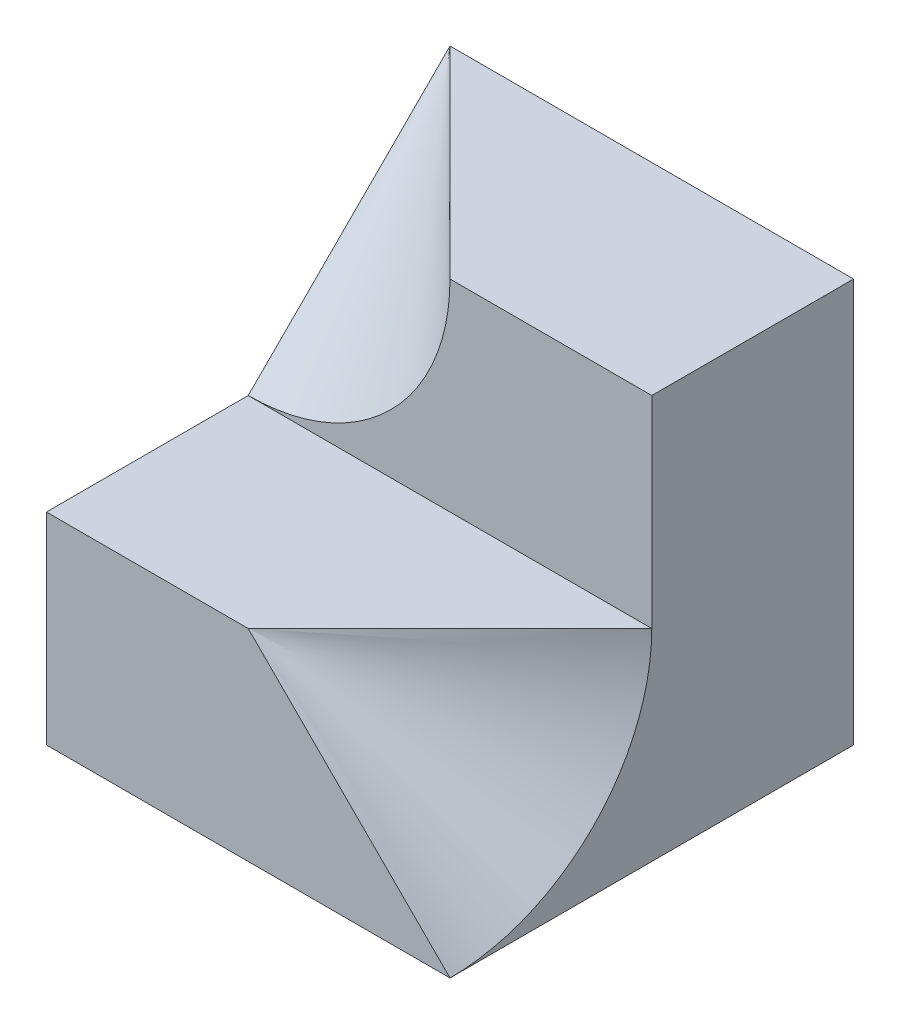
ISO-10303-21;
HEADER;
FILE_DESCRIPTION(('STEP AP214'),'2;1');
FILE_NAME('part.step','',(''),(''),'','','');
FILE_SCHEMA(('AUTOMOTIVE_DESIGN { 1 0 10303 214 1 1 1 1 }'));
ENDSEC;
DATA;
#1=APPLICATION_CONTEXT('core data for automotive mechanical design processes');
#2=APPLICATION_PROTOCOL_DEFINITION('international standard','automotive_design',2000,#1);
#3=PRODUCT_CONTEXT('',#1,'mechanical');
#4=PRODUCT('Part','Part','',(#3));
#5=PRODUCT_RELATED_PRODUCT_CATEGORY('part','',(#4));
#6=PRODUCT_DEFINITION_FORMATION('','',#4);
#7=PRODUCT_DEFINITION_CONTEXT('part definition',#1,'design');
#8=PRODUCT_DEFINITION('design','',#6,#7);
#9=PRODUCT_DEFINITION_SHAPE('','',#8);
#10=(LENGTH_UNIT() NAMED_UNIT(*) SI_UNIT(.MILLI.,.METRE.));
#11=(NAMED_UNIT(*) PLANE_ANGLE_UNIT() SI_UNIT($,.RADIAN.));
#12=(NAMED_UNIT(*) SI_UNIT($,.STERADIAN.) SOLID_ANGLE_UNIT());
#13=UNCERTAINTY_MEASURE_WITH_UNIT(LENGTH_MEASURE(1.E-05),#10,'distance_accuracy_value','');
#14=(GEOMETRIC_REPRESENTATION_CONTEXT(3) GLOBAL_UNCERTAINTY_ASSIGNED_CONTEXT((#13)) GLOBAL_UNIT_ASSIGNED_CONTEXT((#10,
#11,#12)) REPRESENTATION_CONTEXT('',''));
#15=CARTESIAN_POINT('',(0.,0.,0.));
#16=DIRECTION('',(0.,0.,1.));
#17=DIRECTION('',(1.,0.,0.));
#18=AXIS2_PLACEMENT_3D('',#15,#16,#17);
#19=CARTESIAN_POINT('',(0.,4.,0.));
#20=DIRECTION('',(0.,0.,-1.));
#21=DIRECTION('',(-1.,0.,0.));
#22=AXIS2_PLACEMENT_3D('',#19,#20,#21);
#23=PLANE('',#22);
#24=DIRECTION('',(-0.707106781186548,0.707106781186547,0.));
#25=VECTOR('',#24,1.);
#26=CARTESIAN_POINT('',(2.,2.,0.));
#27=LINE('',#26,#25);
#28=CARTESIAN_POINT('',(2.,2.,0.));
#29=VERTEX_POINT('',#28);
#30=CARTESIAN_POINT('',(4.,0.,0.));
#31=VERTEX_POINT('',#30);
#32=EDGE_CURVE('E132',#29,#31,#27,.F.);
#33=ORIENTED_EDGE('',*,*,#32,.F.);
#34=DIRECTION('',(-1.,0.,0.));
#35=VECTOR('',#34,1.);
#36=CARTESIAN_POINT('',(4.,2.,0.));
#37=LINE('',#36,#35);
#38=CARTESIAN_POINT('',(0.,2.,0.));
#39=VERTEX_POINT('',#38);
#40=EDGE_CURVE('E107',#29,#39,#37,.T.);
#41=ORIENTED_EDGE('',*,*,#40,.T.);
#42=DIRECTION('',(0.,-1.,0.));
#43=VECTOR('',#42,1.);
#44=CARTESIAN_POINT('',(0.,4.,0.));
#45=LINE('',#44,#43);
#46=CARTESIAN_POINT('',(0.,0.,0.));
#47=VERTEX_POINT('',#46);
#48=EDGE_CURVE('E41',#39,#47,#45,.T.);
#49=ORIENTED_EDGE('',*,*,#48,.T.);
#50=DIRECTION('',(1.,0.,0.));
#51=VECTOR('',#50,1.);
#52=CARTESIAN_POINT('',(0.,0.,0.));
#53=LINE('',#52,#51);
#54=EDGE_CURVE('E85',#47,#31,#53,.T.);
#55=ORIENTED_EDGE('',*,*,#54,.T.);
#56=EDGE_LOOP('',(#33,#41,#49,#55));
#57=FACE_BOUND('',#56,.T.);
#58=ADVANCED_FACE('F33',(#57),#23,.F.);
#59=CARTESIAN_POINT('',(4.,2.,-2.));
#60=DIRECTION('',(0.,-1.,0.));
#61=DIRECTION('',(0.,0.,-1.));
#62=AXIS2_PLACEMENT_3D('',#59,#60,#61);
#63=PLANE('',#62);
#64=DIRECTION('',(0.707106781186548,0.,-0.707106781186547));
#65=VECTOR('',#64,1.);
#66=CARTESIAN_POINT('',(2.,2.,0.));
#67=LINE('',#66,#65);
#68=CARTESIAN_POINT('',(4.,2.,-2.));
#69=VERTEX_POINT('',#68);
#70=EDGE_CURVE('E11',#69,#29,#67,.F.);
#71=ORIENTED_EDGE('',*,*,#70,.F.);
#72=DIRECTION('',(-1.,0.,0.));
#73=VECTOR('',#72,1.);
#74=CARTESIAN_POINT('',(4.,2.,-2.));
#75=LINE('',#74,#73);
#76=CARTESIAN_POINT('',(0.,2.,-2.));
#77=VERTEX_POINT('',#76);
#78=EDGE_CURVE('E117',#69,#77,#75,.T.);
#79=ORIENTED_EDGE('',*,*,#78,.T.);
#80=DIRECTION('',(0.,0.,1.));
#81=VECTOR('',#80,1.);
#82=CARTESIAN_POINT('',(0.,2.,-2.));
#83=LINE('',#82,#81);
#84=EDGE_CURVE('E121',#77,#39,#83,.T.);
#85=ORIENTED_EDGE('',*,*,#84,.T.);
#86=ORIENTED_EDGE('',*,*,#40,.F.);
#87=EDGE_LOOP('',(#71,#79,#85,#86));
#88=FACE_BOUND('',#87,.T.);
#89=ADVANCED_FACE('F141',(#88),#63,.F.);
#90=CARTESIAN_POINT('',(0.,4.,0.));
#91=DIRECTION('',(1.,0.,0.));
#92=DIRECTION('',(0.,0.,-1.));
#93=AXIS2_PLACEMENT_3D('',#90,#91,#92);
#94=PLANE('',#93);
#95=ORIENTED_EDGE('',*,*,#84,.F.);
#96=DIRECTION('',(0.,0.707106781186547,-0.707106781186548));
#97=VECTOR('',#96,1.);
#98=CARTESIAN_POINT('',(0.,4.,-4.));
#99=LINE('',#98,#97);
#100=CARTESIAN_POINT('',(0.,4.,-4.));
#101=VERTEX_POINT('',#100);
#102=EDGE_CURVE('E123',#77,#101,#99,.T.);
#103=ORIENTED_EDGE('',*,*,#102,.T.);
#104=DIRECTION('',(0.,-1.,0.));
#105=VECTOR('',#104,1.);
#106=CARTESIAN_POINT('',(0.,4.,-4.));
#107=LINE('',#106,#105);
#108=CARTESIAN_POINT('',(0.,0.,-4.));
#109=VERTEX_POINT('',#108);
#110=EDGE_CURVE('E92',#101,#109,#107,.T.);
#111=ORIENTED_EDGE('',*,*,#110,.T.);
#112=DIRECTION('',(0.,0.,1.));
#113=VECTOR('',#112,1.);
#114=CARTESIAN_POINT('',(0.,0.,0.));
#115=LINE('',#114,#113);
#116=EDGE_CURVE('E97',#109,#47,#115,.T.);
#117=ORIENTED_EDGE('',*,*,#116,.T.);
#118=ORIENTED_EDGE('',*,*,#48,.F.);
#119=EDGE_LOOP('',(#95,#103,#111,#117,#118));
#120=FACE_BOUND('',#119,.T.);
#121=ADVANCED_FACE('F35',(#120),#94,.F.);
#122=CARTESIAN_POINT('',(4.,4.,0.));
#123=DIRECTION('',(-1.,0.,0.));
#124=DIRECTION('',(0.,0.,1.));
#125=AXIS2_PLACEMENT_3D('',#122,#123,#124);
#126=PLANE('',#125);
#127=CARTESIAN_POINT('',(4.,2.,0.));
#128=DIRECTION('',(1.,0.,0.));
#129=DIRECTION('',(0.,0.,-1.));
#130=AXIS2_PLACEMENT_3D('',#127,#128,#129);
#131=CIRCLE('',#130,2.);
#132=EDGE_CURVE('E79',#31,#69,#131,.T.);
#133=ORIENTED_EDGE('',*,*,#132,.F.);
#134=DIRECTION('',(0.,0.,-1.));
#135=VECTOR('',#134,1.);
#136=CARTESIAN_POINT('',(4.,0.,0.));
#137=LINE('',#136,#135);
#138=CARTESIAN_POINT('',(4.,0.,-4.));
#139=VERTEX_POINT('',#138);
#140=EDGE_CURVE('E72',#31,#139,#137,.T.);
#141=ORIENTED_EDGE('',*,*,#140,.T.);
#142=DIRECTION('',(0.,-1.,0.));
#143=VECTOR('',#142,1.);
#144=CARTESIAN_POINT('',(4.,4.,-4.));
#145=LINE('',#144,#143);
#146=CARTESIAN_POINT('',(4.,4.,-4.));
#147=VERTEX_POINT('',#146);
#148=EDGE_CURVE('E75',#147,#139,#145,.T.);
#149=ORIENTED_EDGE('',*,*,#148,.F.);
#150=DIRECTION('',(0.,0.,-1.));
#151=VECTOR('',#150,1.);
#152=CARTESIAN_POINT('',(4.,4.,0.));
#153=LINE('',#152,#151);
#154=CARTESIAN_POINT('',(4.,4.,-2.));
#155=VERTEX_POINT('',#154);
#156=EDGE_CURVE('E56',#155,#147,#153,.T.);
#157=ORIENTED_EDGE('',*,*,#156,.F.);
#158=DIRECTION('',(0.,-1.,0.));
#159=VECTOR('',#158,1.);
#160=CARTESIAN_POINT('',(4.,4.,-2.));
#161=LINE('',#160,#159);
#162=EDGE_CURVE('E48',#155,#69,#161,.T.);
#163=ORIENTED_EDGE('',*,*,#162,.T.);
#164=EDGE_LOOP('',(#133,#141,#149,#157,#163));
#165=FACE_BOUND('',#164,.T.);
#166=ADVANCED_FACE('F74',(#165),#126,.F.);
#167=CARTESIAN_POINT('',(0.,4.,-4.));
#168=DIRECTION('',(0.,0.,1.));
#169=DIRECTION('',(1.,0.,0.));
#170=AXIS2_PLACEMENT_3D('',#167,#168,#169);
#171=PLANE('',#170);
#172=DIRECTION('',(-1.,0.,0.));
#173=VECTOR('',#172,1.);
#174=CARTESIAN_POINT('',(0.,0.,-4.));
#175=LINE('',#174,#173);
#176=EDGE_CURVE('E84',#139,#109,#175,.T.);
#177=ORIENTED_EDGE('',*,*,#176,.T.);
#178=ORIENTED_EDGE('',*,*,#110,.F.);
#179=DIRECTION('',(-1.,0.,0.));
#180=VECTOR('',#179,1.);
#181=CARTESIAN_POINT('',(0.,4.,-4.));
#182=LINE('',#181,#180);
#183=EDGE_CURVE('E91',#147,#101,#182,.T.);
#184=ORIENTED_EDGE('',*,*,#183,.F.);
#185=ORIENTED_EDGE('',*,*,#148,.T.);
#186=EDGE_LOOP('',(#177,#178,#184,#185));
#187=FACE_BOUND('',#186,.T.);
#188=ADVANCED_FACE('F88',(#187),#171,.F.);
#189=CARTESIAN_POINT('',(0.,4.,0.));
#190=DIRECTION('',(0.,-1.,0.));
#191=DIRECTION('',(0.,0.,-1.));
#192=AXIS2_PLACEMENT_3D('',#189,#190,#191);
#193=PLANE('',#192);
#194=ORIENTED_EDGE('',*,*,#183,.T.);
#195=DIRECTION('',(0.707106781186547,0.,0.707106781186548));
#196=VECTOR('',#195,1.);
#197=CARTESIAN_POINT('',(0.,4.,-4.));
#198=LINE('',#197,#196);
#199=CARTESIAN_POINT('',(2.,4.,-2.));
#200=VERTEX_POINT('',#199);
#201=EDGE_CURVE('E126',#101,#200,#198,.T.);
#202=ORIENTED_EDGE('',*,*,#201,.T.);
#203=DIRECTION('',(-1.,0.,0.));
#204=VECTOR('',#203,1.);
#205=CARTESIAN_POINT('',(4.,4.,-2.));
#206=LINE('',#205,#204);
#207=EDGE_CURVE('E112',#155,#200,#206,.T.);
#208=ORIENTED_EDGE('',*,*,#207,.F.);
#209=ORIENTED_EDGE('',*,*,#156,.T.);
#210=EDGE_LOOP('',(#194,#202,#208,#209));
#211=FACE_BOUND('',#210,.T.);
#212=ADVANCED_FACE('F152',(#211),#193,.F.);
#213=CARTESIAN_POINT('',(0.,0.,0.));
#214=DIRECTION('',(0.,-1.,0.));
#215=DIRECTION('',(0.,0.,-1.));
#216=AXIS2_PLACEMENT_3D('',#213,#214,#215);
#217=PLANE('',#216);
#218=ORIENTED_EDGE('',*,*,#116,.F.);
#219=ORIENTED_EDGE('',*,*,#176,.F.);
#220=ORIENTED_EDGE('',*,*,#140,.F.);
#221=ORIENTED_EDGE('',*,*,#54,.F.);
#222=EDGE_LOOP('',(#218,#219,#220,#221));
#223=FACE_BOUND('',#222,.T.);
#224=ADVANCED_FACE('F95',(#223),#217,.T.);
#225=CARTESIAN_POINT('',(4.,4.,-2.));
#226=DIRECTION('',(0.,0.,-1.));
#227=DIRECTION('',(-1.,0.,0.));
#228=AXIS2_PLACEMENT_3D('',#225,#226,#227);
#229=PLANE('',#228);
#230=ORIENTED_EDGE('',*,*,#207,.T.);
#231=CARTESIAN_POINT('',(0.,4.,-2.));
#232=DIRECTION('',(0.,0.,-1.));
#233=DIRECTION('',(-1.,0.,0.));
#234=AXIS2_PLACEMENT_3D('',#231,#232,#233);
#235=CIRCLE('',#234,2.);
#236=EDGE_CURVE('E129',#200,#77,#235,.T.);
#237=ORIENTED_EDGE('',*,*,#236,.T.);
#238=ORIENTED_EDGE('',*,*,#78,.F.);
#239=ORIENTED_EDGE('',*,*,#162,.F.);
#240=EDGE_LOOP('',(#230,#237,#238,#239));
#241=FACE_BOUND('',#240,.T.);
#242=ADVANCED_FACE('F143',(#241),#229,.F.);
#243=CARTESIAN_POINT('',(0.,4.,-4.));
#244=DIRECTION('',(0.,0.,1.));
#245=DIRECTION('',(1.,0.,0.));
#246=AXIS2_PLACEMENT_3D('',#243,#244,#245);
#247=CONICAL_SURFACE('',#246,0.,0.785398163397448);
#248=ORIENTED_EDGE('',*,*,#236,.F.);
#249=ORIENTED_EDGE('',*,*,#201,.F.);
#250=ORIENTED_EDGE('',*,*,#102,.F.);
#251=EDGE_LOOP('',(#248,#249,#250));
#252=FACE_BOUND('',#251,.T.);
#253=ADVANCED_FACE('F149',(#252),#247,.F.);
#254=CARTESIAN_POINT('',(2.,2.,0.));
#255=DIRECTION('',(1.,0.,0.));
#256=DIRECTION('',(0.,0.,-1.));
#257=AXIS2_PLACEMENT_3D('',#254,#255,#256);
#258=CONICAL_SURFACE('',#257,0.,0.785398163397448);
#259=ORIENTED_EDGE('',*,*,#32,.T.);
#260=ORIENTED_EDGE('',*,*,#132,.T.);
#261=ORIENTED_EDGE('',*,*,#70,.T.);
#262=EDGE_LOOP('',(#259,#260,#261));
#263=FACE_BOUND('',#262,.T.);
#264=ADVANCED_FACE('F137',(#263),#258,.F.);
#265=CLOSED_SHELL('',(#58,#89,#121,#166,#188,#212,#224,#242,#253,#264));
#266=MANIFOLD_SOLID_BREP('B2',#265);
#267=ADVANCED_BREP_SHAPE_REPRESENTATION('',(#18,#266),#14);
#268=SHAPE_DEFINITION_REPRESENTATION(#9,#267);
ENDSEC;
END-ISO-10303-21;
